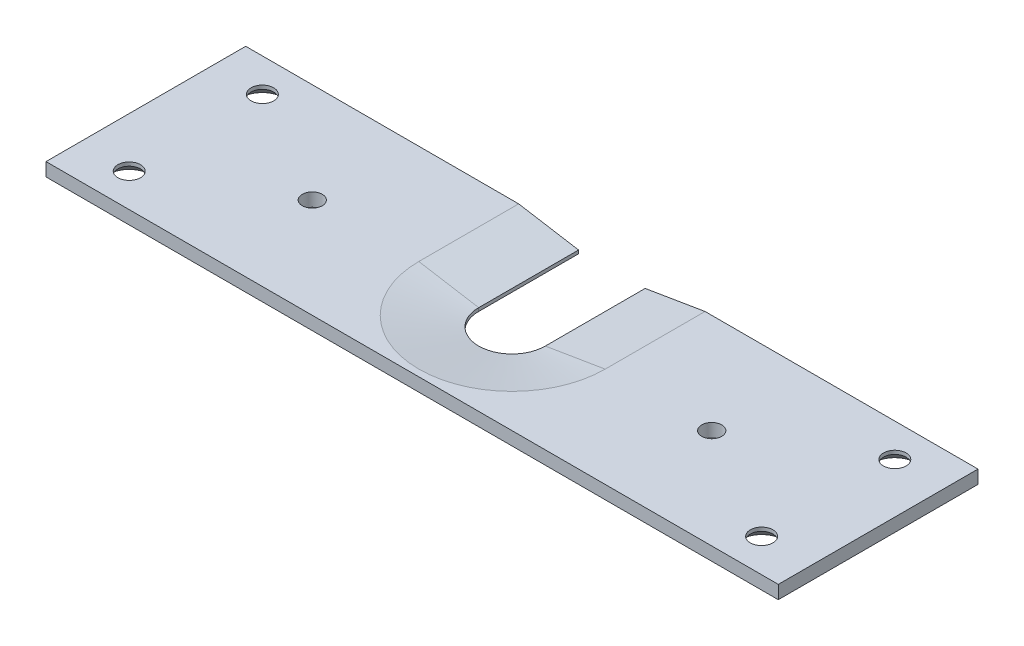
ISO-10303-21;
HEADER;
FILE_DESCRIPTION(('STEP AP214'),'2;1');
FILE_NAME('part.step','',(''),(''),'','','');
FILE_SCHEMA(('AUTOMOTIVE_DESIGN { 1 0 10303 214 1 1 1 1 }'));
ENDSEC;
DATA;
#1=APPLICATION_CONTEXT('core data for automotive mechanical design processes');
#2=APPLICATION_PROTOCOL_DEFINITION('international standard','automotive_design',2000,#1);
#3=PRODUCT_CONTEXT('',#1,'mechanical');
#4=PRODUCT('Part','Part','',(#3));
#5=PRODUCT_RELATED_PRODUCT_CATEGORY('part','',(#4));
#6=PRODUCT_DEFINITION_FORMATION('','',#4);
#7=PRODUCT_DEFINITION_CONTEXT('part definition',#1,'design');
#8=PRODUCT_DEFINITION('design','',#6,#7);
#9=PRODUCT_DEFINITION_SHAPE('','',#8);
#10=(LENGTH_UNIT() NAMED_UNIT(*) SI_UNIT(.MILLI.,.METRE.));
#11=(NAMED_UNIT(*) PLANE_ANGLE_UNIT() SI_UNIT($,.RADIAN.));
#12=(NAMED_UNIT(*) SI_UNIT($,.STERADIAN.) SOLID_ANGLE_UNIT());
#13=UNCERTAINTY_MEASURE_WITH_UNIT(LENGTH_MEASURE(1.E-05),#10,'distance_accuracy_value','');
#14=(GEOMETRIC_REPRESENTATION_CONTEXT(3) GLOBAL_UNCERTAINTY_ASSIGNED_CONTEXT((#13)) GLOBAL_UNIT_ASSIGNED_CONTEXT((#10,
#11,#12)) REPRESENTATION_CONTEXT('',''));
#15=CARTESIAN_POINT('',(0.,0.,0.));
#16=DIRECTION('',(0.,0.,1.));
#17=DIRECTION('',(1.,0.,0.));
#18=AXIS2_PLACEMENT_3D('',#15,#16,#17);
#19=CARTESIAN_POINT('',(-55.,2.,15.));
#20=DIRECTION('',(0.,1.,0.));
#21=DIRECTION('',(0.,0.,1.));
#22=AXIS2_PLACEMENT_3D('',#19,#20,#21);
#23=PLANE('',#22);
#24=CARTESIAN_POINT('',(29.9999999999998,2.,0.));
#25=DIRECTION('',(0.,1.,0.));
#26=DIRECTION('',(0.,0.,1.));
#27=AXIS2_PLACEMENT_3D('',#24,#25,#26);
#28=CIRCLE('',#27,1.49999999999999);
#29=CARTESIAN_POINT('',(29.9999999999998,2.,1.49999999999994));
#30=VERTEX_POINT('',#29);
#31=EDGE_CURVE('E248',#30,#30,#28,.T.);
#32=ORIENTED_EDGE('',*,*,#31,.F.);
#33=EDGE_LOOP('',(#32));
#34=FACE_BOUND('',#33,.T.);
#35=CARTESIAN_POINT('',(-30.,2.,0.));
#36=DIRECTION('',(0.,1.,0.));
#37=DIRECTION('',(0.,0.,1.));
#38=AXIS2_PLACEMENT_3D('',#35,#36,#37);
#39=CIRCLE('',#38,1.49999999999999);
#40=CARTESIAN_POINT('',(-30.,2.,1.49999999999999));
#41=VERTEX_POINT('',#40);
#42=EDGE_CURVE('E242',#41,#41,#39,.T.);
#43=ORIENTED_EDGE('',*,*,#42,.F.);
#44=EDGE_LOOP('',(#43));
#45=FACE_BOUND('',#44,.T.);
#46=CARTESIAN_POINT('',(-47.5,2.00000000000005,-10.));
#47=DIRECTION('',(0.,-1.,0.));
#48=DIRECTION('',(0.,0.,-1.));
#49=AXIS2_PLACEMENT_3D('',#46,#47,#48);
#50=CIRCLE('',#49,1.7);
#51=CARTESIAN_POINT('',(-47.5,2.00000000000005,-11.7));
#52=VERTEX_POINT('',#51);
#53=EDGE_CURVE('E227',#52,#52,#50,.T.);
#54=ORIENTED_EDGE('',*,*,#53,.T.);
#55=EDGE_LOOP('',(#54));
#56=FACE_BOUND('',#55,.T.);
#57=CARTESIAN_POINT('',(47.5,2.00000000000005,10.));
#58=DIRECTION('',(0.,-1.,0.));
#59=DIRECTION('',(0.,0.,-1.));
#60=AXIS2_PLACEMENT_3D('',#57,#58,#59);
#61=CIRCLE('',#60,1.7);
#62=CARTESIAN_POINT('',(47.5,2.00000000000005,8.3));
#63=VERTEX_POINT('',#62);
#64=EDGE_CURVE('E209',#63,#63,#61,.T.);
#65=ORIENTED_EDGE('',*,*,#64,.T.);
#66=EDGE_LOOP('',(#65));
#67=FACE_BOUND('',#66,.T.);
#68=DIRECTION('',(-1.,0.,0.));
#69=VECTOR('',#68,1.);
#70=CARTESIAN_POINT('',(-55.,2.,-15.));
#71=LINE('',#70,#69);
#72=CARTESIAN_POINT('',(55.,2.,-15.));
#73=VERTEX_POINT('',#72);
#74=CARTESIAN_POINT('',(14.0000000000002,2.,-15.));
#75=VERTEX_POINT('',#74);
#76=EDGE_CURVE('E164',#73,#75,#71,.T.);
#77=ORIENTED_EDGE('',*,*,#76,.T.);
#78=DIRECTION('',(0.,0.,1.));
#79=VECTOR('',#78,1.);
#80=CARTESIAN_POINT('',(14.0000000000002,2.,0.));
#81=LINE('',#80,#79);
#82=CARTESIAN_POINT('',(14.0000000000002,2.,0.));
#83=VERTEX_POINT('',#82);
#84=EDGE_CURVE('E187',#75,#83,#81,.T.);
#85=ORIENTED_EDGE('',*,*,#84,.T.);
#86=CARTESIAN_POINT('',(0.,2.,0.));
#87=DIRECTION('',(0.,1.,0.));
#88=DIRECTION('',(0.,0.,1.));
#89=AXIS2_PLACEMENT_3D('',#86,#87,#88);
#90=CIRCLE('',#89,14.0000000000002);
#91=CARTESIAN_POINT('',(-14.0000000000002,2.,0.));
#92=VERTEX_POINT('',#91);
#93=EDGE_CURVE('E185',#83,#92,#90,.F.);
#94=ORIENTED_EDGE('',*,*,#93,.T.);
#95=DIRECTION('',(0.,0.,-1.));
#96=VECTOR('',#95,1.);
#97=CARTESIAN_POINT('',(-14.0000000000002,2.,-15.));
#98=LINE('',#97,#96);
#99=CARTESIAN_POINT('',(-14.0000000000008,2.00000000000005,-15.));
#100=VERTEX_POINT('',#99);
#101=EDGE_CURVE('E183',#92,#100,#98,.T.);
#102=ORIENTED_EDGE('',*,*,#101,.T.);
#103=CARTESIAN_POINT('',(-55.,2.,-15.));
#104=VERTEX_POINT('',#103);
#105=EDGE_CURVE('E163',#100,#104,#71,.T.);
#106=ORIENTED_EDGE('',*,*,#105,.T.);
#107=DIRECTION('',(0.,0.,1.));
#108=VECTOR('',#107,1.);
#109=CARTESIAN_POINT('',(-55.,2.,-15.));
#110=LINE('',#109,#108);
#111=CARTESIAN_POINT('',(-55.,2.,15.));
#112=VERTEX_POINT('',#111);
#113=EDGE_CURVE('E156',#104,#112,#110,.T.);
#114=ORIENTED_EDGE('',*,*,#113,.T.);
#115=DIRECTION('',(1.,0.,0.));
#116=VECTOR('',#115,1.);
#117=CARTESIAN_POINT('',(-55.,2.,15.));
#118=LINE('',#117,#116);
#119=CARTESIAN_POINT('',(55.,2.,15.));
#120=VERTEX_POINT('',#119);
#121=EDGE_CURVE('E159',#112,#120,#118,.T.);
#122=ORIENTED_EDGE('',*,*,#121,.T.);
#123=DIRECTION('',(0.,0.,-1.));
#124=VECTOR('',#123,1.);
#125=CARTESIAN_POINT('',(55.,2.,-15.));
#126=LINE('',#125,#124);
#127=EDGE_CURVE('E161',#120,#73,#126,.T.);
#128=ORIENTED_EDGE('',*,*,#127,.T.);
#129=EDGE_LOOP('',(#77,#85,#94,#102,#106,#114,#122,#128));
#130=FACE_BOUND('',#129,.T.);
#131=CARTESIAN_POINT('',(-47.5,2.00000000000005,10.));
#132=DIRECTION('',(0.,-1.,0.));
#133=DIRECTION('',(0.,0.,-1.));
#134=AXIS2_PLACEMENT_3D('',#131,#132,#133);
#135=CIRCLE('',#134,1.7);
#136=CARTESIAN_POINT('',(-47.5,2.00000000000005,8.3));
#137=VERTEX_POINT('',#136);
#138=EDGE_CURVE('E218',#137,#137,#135,.T.);
#139=ORIENTED_EDGE('',*,*,#138,.T.);
#140=EDGE_LOOP('',(#139));
#141=FACE_BOUND('',#140,.T.);
#142=CARTESIAN_POINT('',(47.5,2.00000000000005,-10.));
#143=DIRECTION('',(0.,-1.,0.));
#144=DIRECTION('',(0.,0.,-1.));
#145=AXIS2_PLACEMENT_3D('',#142,#143,#144);
#146=CIRCLE('',#145,1.7);
#147=CARTESIAN_POINT('',(47.5,2.00000000000005,-11.7));
#148=VERTEX_POINT('',#147);
#149=EDGE_CURVE('E236',#148,#148,#146,.T.);
#150=ORIENTED_EDGE('',*,*,#149,.T.);
#151=EDGE_LOOP('',(#150));
#152=FACE_BOUND('',#151,.T.);
#153=ADVANCED_FACE('F33',(#34,#45,#56,#67,#130,#141,#152),#23,.T.);
#154=CARTESIAN_POINT('',(-55.,2.,-15.));
#155=DIRECTION('',(0.,0.,1.));
#156=DIRECTION('',(1.,0.,0.));
#157=AXIS2_PLACEMENT_3D('',#154,#155,#156);
#158=PLANE('',#157);
#159=ORIENTED_EDGE('',*,*,#105,.F.);
#160=DIRECTION('',(0.986393923832144,-0.164398987305354,0.));
#161=VECTOR('',#160,1.);
#162=CARTESIAN_POINT('',(-5.,0.499999999999999,-15.));
#163=LINE('',#162,#161);
#164=CARTESIAN_POINT('',(-5.,0.499999999999999,-15.));
#165=VERTEX_POINT('',#164);
#166=EDGE_CURVE('E11',#100,#165,#163,.T.);
#167=ORIENTED_EDGE('',*,*,#166,.T.);
#168=DIRECTION('',(0.,1.,0.));
#169=VECTOR('',#168,1.);
#170=CARTESIAN_POINT('',(-5.,0.,-15.));
#171=LINE('',#170,#169);
#172=CARTESIAN_POINT('',(-5.,0.,-15.));
#173=VERTEX_POINT('',#172);
#174=EDGE_CURVE('E144',#173,#165,#171,.T.);
#175=ORIENTED_EDGE('',*,*,#174,.F.);
#176=DIRECTION('',(-1.,0.,0.));
#177=VECTOR('',#176,1.);
#178=CARTESIAN_POINT('',(-55.,0.,-15.));
#179=LINE('',#178,#177);
#180=CARTESIAN_POINT('',(-55.,0.,-15.));
#181=VERTEX_POINT('',#180);
#182=EDGE_CURVE('E153',#173,#181,#179,.T.);
#183=ORIENTED_EDGE('',*,*,#182,.T.);
#184=DIRECTION('',(0.,-1.,0.));
#185=VECTOR('',#184,1.);
#186=CARTESIAN_POINT('',(-55.,2.,-15.));
#187=LINE('',#186,#185);
#188=EDGE_CURVE('E167',#104,#181,#187,.T.);
#189=ORIENTED_EDGE('',*,*,#188,.F.);
#190=EDGE_LOOP('',(#159,#167,#175,#183,#189));
#191=FACE_BOUND('',#190,.T.);
#192=ADVANCED_FACE('F256',(#191),#158,.F.);
#193=CARTESIAN_POINT('',(-55.,2.,-15.));
#194=DIRECTION('',(1.,0.,0.));
#195=DIRECTION('',(0.,0.,-1.));
#196=AXIS2_PLACEMENT_3D('',#193,#194,#195);
#197=PLANE('',#196);
#198=DIRECTION('',(0.,0.,1.));
#199=VECTOR('',#198,1.);
#200=CARTESIAN_POINT('',(-55.,0.,-15.));
#201=LINE('',#200,#199);
#202=CARTESIAN_POINT('',(-55.,0.,15.));
#203=VERTEX_POINT('',#202);
#204=EDGE_CURVE('E143',#181,#203,#201,.T.);
#205=ORIENTED_EDGE('',*,*,#204,.T.);
#206=DIRECTION('',(0.,-1.,0.));
#207=VECTOR('',#206,1.);
#208=CARTESIAN_POINT('',(-55.,2.,15.));
#209=LINE('',#208,#207);
#210=EDGE_CURVE('E176',#112,#203,#209,.T.);
#211=ORIENTED_EDGE('',*,*,#210,.F.);
#212=ORIENTED_EDGE('',*,*,#113,.F.);
#213=ORIENTED_EDGE('',*,*,#188,.T.);
#214=EDGE_LOOP('',(#205,#211,#212,#213));
#215=FACE_BOUND('',#214,.T.);
#216=ADVANCED_FACE('F35',(#215),#197,.F.);
#217=CARTESIAN_POINT('',(-55.,2.,15.));
#218=DIRECTION('',(0.,0.,-1.));
#219=DIRECTION('',(-1.,0.,0.));
#220=AXIS2_PLACEMENT_3D('',#217,#218,#219);
#221=PLANE('',#220);
#222=DIRECTION('',(1.,0.,0.));
#223=VECTOR('',#222,1.);
#224=CARTESIAN_POINT('',(-55.,0.,15.));
#225=LINE('',#224,#223);
#226=CARTESIAN_POINT('',(55.,0.,15.));
#227=VERTEX_POINT('',#226);
#228=EDGE_CURVE('E149',#203,#227,#225,.T.);
#229=ORIENTED_EDGE('',*,*,#228,.T.);
#230=DIRECTION('',(0.,-1.,0.));
#231=VECTOR('',#230,1.);
#232=CARTESIAN_POINT('',(55.,2.,15.));
#233=LINE('',#232,#231);
#234=EDGE_CURVE('E173',#120,#227,#233,.T.);
#235=ORIENTED_EDGE('',*,*,#234,.F.);
#236=ORIENTED_EDGE('',*,*,#121,.F.);
#237=ORIENTED_EDGE('',*,*,#210,.T.);
#238=EDGE_LOOP('',(#229,#235,#236,#237));
#239=FACE_BOUND('',#238,.T.);
#240=ADVANCED_FACE('F294',(#239),#221,.F.);
#241=CARTESIAN_POINT('',(55.,2.,-15.));
#242=DIRECTION('',(-1.,0.,0.));
#243=DIRECTION('',(0.,0.,1.));
#244=AXIS2_PLACEMENT_3D('',#241,#242,#243);
#245=PLANE('',#244);
#246=DIRECTION('',(0.,0.,-1.));
#247=VECTOR('',#246,1.);
#248=CARTESIAN_POINT('',(55.,0.,-15.));
#249=LINE('',#248,#247);
#250=CARTESIAN_POINT('',(55.,0.,-15.));
#251=VERTEX_POINT('',#250);
#252=EDGE_CURVE('E151',#227,#251,#249,.T.);
#253=ORIENTED_EDGE('',*,*,#252,.T.);
#254=DIRECTION('',(0.,-1.,0.));
#255=VECTOR('',#254,1.);
#256=CARTESIAN_POINT('',(55.,2.,-15.));
#257=LINE('',#256,#255);
#258=EDGE_CURVE('E170',#73,#251,#257,.T.);
#259=ORIENTED_EDGE('',*,*,#258,.F.);
#260=ORIENTED_EDGE('',*,*,#127,.F.);
#261=ORIENTED_EDGE('',*,*,#234,.T.);
#262=EDGE_LOOP('',(#253,#259,#260,#261));
#263=FACE_BOUND('',#262,.T.);
#264=ADVANCED_FACE('F287',(#263),#245,.F.);
#265=DIRECTION('',(0.,1.,0.));
#266=VECTOR('',#265,1.);
#267=CARTESIAN_POINT('',(5.,0.,-15.));
#268=LINE('',#267,#266);
#269=CARTESIAN_POINT('',(5.,0.,-15.));
#270=VERTEX_POINT('',#269);
#271=CARTESIAN_POINT('',(5.,0.499999999999999,-15.));
#272=VERTEX_POINT('',#271);
#273=EDGE_CURVE('E120',#270,#272,#268,.T.);
#274=ORIENTED_EDGE('',*,*,#273,.T.);
#275=DIRECTION('',(0.986393923832144,0.164398987305354,0.));
#276=VECTOR('',#275,1.);
#277=CARTESIAN_POINT('',(5.,0.499999999999999,-15.));
#278=LINE('',#277,#276);
#279=EDGE_CURVE('E181',#272,#75,#278,.T.);
#280=ORIENTED_EDGE('',*,*,#279,.T.);
#281=ORIENTED_EDGE('',*,*,#76,.F.);
#282=ORIENTED_EDGE('',*,*,#258,.T.);
#283=EDGE_CURVE('E154',#251,#270,#179,.T.);
#284=ORIENTED_EDGE('',*,*,#283,.T.);
#285=EDGE_LOOP('',(#274,#280,#281,#282,#284));
#286=FACE_BOUND('',#285,.T.);
#287=ADVANCED_FACE('F278',(#286),#158,.F.);
#288=CARTESIAN_POINT('',(-55.,0.,15.));
#289=DIRECTION('',(0.,1.,0.));
#290=DIRECTION('',(0.,0.,1.));
#291=AXIS2_PLACEMENT_3D('',#288,#289,#290);
#292=PLANE('',#291);
#293=CARTESIAN_POINT('',(29.9999999999998,0.,0.));
#294=DIRECTION('',(0.,1.,0.));
#295=DIRECTION('',(0.,0.,1.));
#296=AXIS2_PLACEMENT_3D('',#293,#294,#295);
#297=CIRCLE('',#296,1.5);
#298=CARTESIAN_POINT('',(29.9999999999998,0.,1.49999999999995));
#299=VERTEX_POINT('',#298);
#300=EDGE_CURVE('E245',#299,#299,#297,.T.);
#301=ORIENTED_EDGE('',*,*,#300,.T.);
#302=EDGE_LOOP('',(#301));
#303=FACE_BOUND('',#302,.T.);
#304=CARTESIAN_POINT('',(-30.,0.,0.));
#305=DIRECTION('',(0.,1.,0.));
#306=DIRECTION('',(0.,0.,1.));
#307=AXIS2_PLACEMENT_3D('',#304,#305,#306);
#308=CIRCLE('',#307,1.5);
#309=CARTESIAN_POINT('',(-30.,0.,1.5));
#310=VERTEX_POINT('',#309);
#311=EDGE_CURVE('E239',#310,#310,#308,.T.);
#312=ORIENTED_EDGE('',*,*,#311,.T.);
#313=EDGE_LOOP('',(#312));
#314=FACE_BOUND('',#313,.T.);
#315=CARTESIAN_POINT('',(47.5,0.,-10.));
#316=DIRECTION('',(0.,-1.,0.));
#317=DIRECTION('',(0.,0.,-1.));
#318=AXIS2_PLACEMENT_3D('',#315,#316,#317);
#319=CIRCLE('',#318,3.15);
#320=CARTESIAN_POINT('',(47.5,0.,-13.15));
#321=VERTEX_POINT('',#320);
#322=EDGE_CURVE('E230',#321,#321,#319,.T.);
#323=ORIENTED_EDGE('',*,*,#322,.F.);
#324=EDGE_LOOP('',(#323));
#325=FACE_BOUND('',#324,.T.);
#326=CARTESIAN_POINT('',(-47.5,0.,-10.));
#327=DIRECTION('',(0.,-1.,0.));
#328=DIRECTION('',(0.,0.,-1.));
#329=AXIS2_PLACEMENT_3D('',#326,#327,#328);
#330=CIRCLE('',#329,3.15);
#331=CARTESIAN_POINT('',(-47.5,0.,-13.15));
#332=VERTEX_POINT('',#331);
#333=EDGE_CURVE('E221',#332,#332,#330,.T.);
#334=ORIENTED_EDGE('',*,*,#333,.F.);
#335=EDGE_LOOP('',(#334));
#336=FACE_BOUND('',#335,.T.);
#337=CARTESIAN_POINT('',(-47.5,0.,10.));
#338=DIRECTION('',(0.,-1.,0.));
#339=DIRECTION('',(0.,0.,-1.));
#340=AXIS2_PLACEMENT_3D('',#337,#338,#339);
#341=CIRCLE('',#340,3.15);
#342=CARTESIAN_POINT('',(-47.5,0.,6.85));
#343=VERTEX_POINT('',#342);
#344=EDGE_CURVE('E212',#343,#343,#341,.T.);
#345=ORIENTED_EDGE('',*,*,#344,.F.);
#346=EDGE_LOOP('',(#345));
#347=FACE_BOUND('',#346,.T.);
#348=CARTESIAN_POINT('',(47.5,0.,10.));
#349=DIRECTION('',(0.,-1.,0.));
#350=DIRECTION('',(0.,0.,-1.));
#351=AXIS2_PLACEMENT_3D('',#348,#349,#350);
#352=CIRCLE('',#351,3.15);
#353=CARTESIAN_POINT('',(47.5,0.,6.85));
#354=VERTEX_POINT('',#353);
#355=EDGE_CURVE('E202',#354,#354,#352,.T.);
#356=ORIENTED_EDGE('',*,*,#355,.F.);
#357=EDGE_LOOP('',(#356));
#358=FACE_BOUND('',#357,.T.);
#359=ORIENTED_EDGE('',*,*,#182,.F.);
#360=DIRECTION('',(0.,0.,1.));
#361=VECTOR('',#360,1.);
#362=CARTESIAN_POINT('',(-5.,0.,0.));
#363=LINE('',#362,#361);
#364=CARTESIAN_POINT('',(-5.,0.,0.));
#365=VERTEX_POINT('',#364);
#366=EDGE_CURVE('E121',#173,#365,#363,.T.);
#367=ORIENTED_EDGE('',*,*,#366,.T.);
#368=CARTESIAN_POINT('',(0.,0.,0.));
#369=DIRECTION('',(0.,1.,0.));
#370=DIRECTION('',(0.,0.,1.));
#371=AXIS2_PLACEMENT_3D('',#368,#369,#370);
#372=CIRCLE('',#371,5.);
#373=CARTESIAN_POINT('',(5.,0.,0.));
#374=VERTEX_POINT('',#373);
#375=EDGE_CURVE('E113',#365,#374,#372,.T.);
#376=ORIENTED_EDGE('',*,*,#375,.T.);
#377=DIRECTION('',(0.,0.,-1.));
#378=VECTOR('',#377,1.);
#379=CARTESIAN_POINT('',(5.,0.,0.));
#380=LINE('',#379,#378);
#381=EDGE_CURVE('E124',#374,#270,#380,.T.);
#382=ORIENTED_EDGE('',*,*,#381,.T.);
#383=ORIENTED_EDGE('',*,*,#283,.F.);
#384=ORIENTED_EDGE('',*,*,#252,.F.);
#385=ORIENTED_EDGE('',*,*,#228,.F.);
#386=ORIENTED_EDGE('',*,*,#204,.F.);
#387=EDGE_LOOP('',(#359,#367,#376,#382,#383,#384,#385,#386));
#388=FACE_BOUND('',#387,.T.);
#389=ADVANCED_FACE('F132',(#303,#314,#325,#336,#347,#358,#388),#292,.F.);
#390=CARTESIAN_POINT('',(0.,0.,0.));
#391=DIRECTION('',(0.,1.,0.));
#392=DIRECTION('',(0.,0.,1.));
#393=AXIS2_PLACEMENT_3D('',#390,#391,#392);
#394=CYLINDRICAL_SURFACE('',#393,5.);
#395=DIRECTION('',(0.,1.,0.));
#396=VECTOR('',#395,1.);
#397=CARTESIAN_POINT('',(-5.,0.,0.));
#398=LINE('',#397,#396);
#399=CARTESIAN_POINT('',(-5.,0.499999999999999,0.));
#400=VERTEX_POINT('',#399);
#401=EDGE_CURVE('E141',#365,#400,#398,.T.);
#402=ORIENTED_EDGE('',*,*,#401,.T.);
#403=CARTESIAN_POINT('',(0.,0.499999999999999,0.));
#404=DIRECTION('',(0.,1.,0.));
#405=DIRECTION('',(0.,0.,1.));
#406=AXIS2_PLACEMENT_3D('',#403,#404,#405);
#407=CIRCLE('',#406,5.);
#408=CARTESIAN_POINT('',(5.,0.499999999999999,0.));
#409=VERTEX_POINT('',#408);
#410=EDGE_CURVE('E116',#400,#409,#407,.T.);
#411=ORIENTED_EDGE('',*,*,#410,.T.);
#412=DIRECTION('',(0.,1.,0.));
#413=VECTOR('',#412,1.);
#414=CARTESIAN_POINT('',(5.,0.,0.));
#415=LINE('',#414,#413);
#416=EDGE_CURVE('E109',#374,#409,#415,.T.);
#417=ORIENTED_EDGE('',*,*,#416,.F.);
#418=ORIENTED_EDGE('',*,*,#375,.F.);
#419=EDGE_LOOP('',(#402,#411,#417,#418));
#420=FACE_BOUND('',#419,.T.);
#421=ADVANCED_FACE('F111',(#420),#394,.F.);
#422=CARTESIAN_POINT('',(-5.,0.,0.));
#423=DIRECTION('',(-1.,0.,0.));
#424=DIRECTION('',(0.,0.,1.));
#425=AXIS2_PLACEMENT_3D('',#422,#423,#424);
#426=PLANE('',#425);
#427=ORIENTED_EDGE('',*,*,#174,.T.);
#428=DIRECTION('',(0.,0.,1.));
#429=VECTOR('',#428,1.);
#430=CARTESIAN_POINT('',(-5.,0.499999999999999,0.));
#431=LINE('',#430,#429);
#432=EDGE_CURVE('E41',#165,#400,#431,.T.);
#433=ORIENTED_EDGE('',*,*,#432,.T.);
#434=ORIENTED_EDGE('',*,*,#401,.F.);
#435=ORIENTED_EDGE('',*,*,#366,.F.);
#436=EDGE_LOOP('',(#427,#433,#434,#435));
#437=FACE_BOUND('',#436,.T.);
#438=ADVANCED_FACE('F285',(#437),#426,.F.);
#439=CARTESIAN_POINT('',(5.,0.,0.));
#440=DIRECTION('',(1.,0.,0.));
#441=DIRECTION('',(0.,0.,-1.));
#442=AXIS2_PLACEMENT_3D('',#439,#440,#441);
#443=PLANE('',#442);
#444=ORIENTED_EDGE('',*,*,#416,.T.);
#445=DIRECTION('',(0.,0.,-1.));
#446=VECTOR('',#445,1.);
#447=CARTESIAN_POINT('',(5.,0.499999999999999,-15.));
#448=LINE('',#447,#446);
#449=EDGE_CURVE('E179',#409,#272,#448,.T.);
#450=ORIENTED_EDGE('',*,*,#449,.T.);
#451=ORIENTED_EDGE('',*,*,#273,.F.);
#452=ORIENTED_EDGE('',*,*,#381,.F.);
#453=EDGE_LOOP('',(#444,#450,#451,#452));
#454=FACE_BOUND('',#453,.T.);
#455=ADVANCED_FACE('F125',(#454),#443,.F.);
#456=CARTESIAN_POINT('',(-5.,0.499999999999999,0.));
#457=DIRECTION('',(0.164398987305354,0.986393923832144,0.));
#458=DIRECTION('',(-0.986393923832144,0.164398987305354,0.));
#459=AXIS2_PLACEMENT_3D('',#456,#457,#458);
#460=PLANE('',#459);
#461=ORIENTED_EDGE('',*,*,#166,.F.);
#462=ORIENTED_EDGE('',*,*,#101,.F.);
#463=DIRECTION('',(-0.986393923832144,0.164398987305354,0.));
#464=VECTOR('',#463,1.);
#465=CARTESIAN_POINT('',(-5.,0.499999999999999,0.));
#466=LINE('',#465,#464);
#467=EDGE_CURVE('E133',#400,#92,#466,.T.);
#468=ORIENTED_EDGE('',*,*,#467,.F.);
#469=ORIENTED_EDGE('',*,*,#432,.F.);
#470=EDGE_LOOP('',(#461,#462,#468,#469));
#471=FACE_BOUND('',#470,.T.);
#472=ADVANCED_FACE('F311',(#471),#460,.T.);
#473=CARTESIAN_POINT('',(0.,0.499999999999999,0.));
#474=DIRECTION('',(0.,1.,0.));
#475=DIRECTION('',(0.,0.,1.));
#476=AXIS2_PLACEMENT_3D('',#473,#474,#475);
#477=CONICAL_SURFACE('',#476,5.,1.40564764938027);
#478=ORIENTED_EDGE('',*,*,#467,.T.);
#479=ORIENTED_EDGE('',*,*,#93,.F.);
#480=DIRECTION('',(0.986393923832144,0.164398987305354,0.));
#481=VECTOR('',#480,1.);
#482=CARTESIAN_POINT('',(5.,0.499999999999999,0.));
#483=LINE('',#482,#481);
#484=EDGE_CURVE('E136',#409,#83,#483,.T.);
#485=ORIENTED_EDGE('',*,*,#484,.F.);
#486=ORIENTED_EDGE('',*,*,#410,.F.);
#487=EDGE_LOOP('',(#478,#479,#485,#486));
#488=FACE_BOUND('',#487,.T.);
#489=ADVANCED_FACE('F198',(#488),#477,.F.);
#490=CARTESIAN_POINT('',(5.,0.499999999999999,0.));
#491=DIRECTION('',(-0.164398987305354,0.986393923832144,0.));
#492=DIRECTION('',(-0.986393923832144,-0.164398987305354,0.));
#493=AXIS2_PLACEMENT_3D('',#490,#491,#492);
#494=PLANE('',#493);
#495=ORIENTED_EDGE('',*,*,#484,.T.);
#496=ORIENTED_EDGE('',*,*,#84,.F.);
#497=ORIENTED_EDGE('',*,*,#279,.F.);
#498=ORIENTED_EDGE('',*,*,#449,.F.);
#499=EDGE_LOOP('',(#495,#496,#497,#498));
#500=FACE_BOUND('',#499,.T.);
#501=ADVANCED_FACE('F201',(#500),#494,.T.);
#502=CARTESIAN_POINT('',(47.5,0.,10.));
#503=DIRECTION('',(0.,-1.,0.));
#504=DIRECTION('',(0.,0.,-1.));
#505=AXIS2_PLACEMENT_3D('',#502,#503,#504);
#506=CONICAL_SURFACE('',#505,3.15,0.785398163397449);
#507=CARTESIAN_POINT('',(47.5,1.45,10.));
#508=DIRECTION('',(0.,-1.,0.));
#509=DIRECTION('',(0.,0.,-1.));
#510=AXIS2_PLACEMENT_3D('',#507,#508,#509);
#511=CIRCLE('',#510,1.7);
#512=CARTESIAN_POINT('',(47.5,1.45,8.3));
#513=VERTEX_POINT('',#512);
#514=EDGE_CURVE('E204',#513,#513,#511,.T.);
#515=ORIENTED_EDGE('',*,*,#514,.F.);
#516=EDGE_LOOP('',(#515));
#517=FACE_BOUND('',#516,.T.);
#518=ORIENTED_EDGE('',*,*,#355,.T.);
#519=EDGE_LOOP('',(#518));
#520=FACE_BOUND('',#519,.T.);
#521=ADVANCED_FACE('F268',(#517,#520),#506,.F.);
#522=CARTESIAN_POINT('',(47.5,0.,10.));
#523=DIRECTION('',(0.,-1.,0.));
#524=DIRECTION('',(0.,0.,-1.));
#525=AXIS2_PLACEMENT_3D('',#522,#523,#524);
#526=CYLINDRICAL_SURFACE('',#525,1.7);
#527=ORIENTED_EDGE('',*,*,#64,.F.);
#528=EDGE_LOOP('',(#527));
#529=FACE_BOUND('',#528,.T.);
#530=ORIENTED_EDGE('',*,*,#514,.T.);
#531=EDGE_LOOP('',(#530));
#532=FACE_BOUND('',#531,.T.);
#533=ADVANCED_FACE('F264',(#529,#532),#526,.F.);
#534=CARTESIAN_POINT('',(-47.5,0.,10.));
#535=DIRECTION('',(0.,-1.,0.));
#536=DIRECTION('',(0.,0.,-1.));
#537=AXIS2_PLACEMENT_3D('',#534,#535,#536);
#538=CONICAL_SURFACE('',#537,3.15,0.785398163397449);
#539=CARTESIAN_POINT('',(-47.5,1.45,10.));
#540=DIRECTION('',(0.,-1.,0.));
#541=DIRECTION('',(0.,0.,-1.));
#542=AXIS2_PLACEMENT_3D('',#539,#540,#541);
#543=CIRCLE('',#542,1.7);
#544=CARTESIAN_POINT('',(-47.5,1.45,8.3));
#545=VERTEX_POINT('',#544);
#546=EDGE_CURVE('E215',#545,#545,#543,.T.);
#547=ORIENTED_EDGE('',*,*,#546,.F.);
#548=EDGE_LOOP('',(#547));
#549=FACE_BOUND('',#548,.T.);
#550=ORIENTED_EDGE('',*,*,#344,.T.);
#551=EDGE_LOOP('',(#550));
#552=FACE_BOUND('',#551,.T.);
#553=ADVANCED_FACE('F267',(#549,#552),#538,.F.);
#554=CARTESIAN_POINT('',(-47.5,0.,10.));
#555=DIRECTION('',(0.,-1.,0.));
#556=DIRECTION('',(0.,0.,-1.));
#557=AXIS2_PLACEMENT_3D('',#554,#555,#556);
#558=CYLINDRICAL_SURFACE('',#557,1.7);
#559=ORIENTED_EDGE('',*,*,#138,.F.);
#560=EDGE_LOOP('',(#559));
#561=FACE_BOUND('',#560,.T.);
#562=ORIENTED_EDGE('',*,*,#546,.T.);
#563=EDGE_LOOP('',(#562));
#564=FACE_BOUND('',#563,.T.);
#565=ADVANCED_FACE('F369',(#561,#564),#558,.F.);
#566=CARTESIAN_POINT('',(-47.5,0.,-10.));
#567=DIRECTION('',(0.,-1.,0.));
#568=DIRECTION('',(0.,0.,-1.));
#569=AXIS2_PLACEMENT_3D('',#566,#567,#568);
#570=CONICAL_SURFACE('',#569,3.15,0.785398163397449);
#571=CARTESIAN_POINT('',(-47.5,1.45,-10.));
#572=DIRECTION('',(0.,-1.,0.));
#573=DIRECTION('',(0.,0.,-1.));
#574=AXIS2_PLACEMENT_3D('',#571,#572,#573);
#575=CIRCLE('',#574,1.7);
#576=CARTESIAN_POINT('',(-47.5,1.45,-11.7));
#577=VERTEX_POINT('',#576);
#578=EDGE_CURVE('E224',#577,#577,#575,.T.);
#579=ORIENTED_EDGE('',*,*,#578,.F.);
#580=EDGE_LOOP('',(#579));
#581=FACE_BOUND('',#580,.T.);
#582=ORIENTED_EDGE('',*,*,#333,.T.);
#583=EDGE_LOOP('',(#582));
#584=FACE_BOUND('',#583,.T.);
#585=ADVANCED_FACE('F379',(#581,#584),#570,.F.);
#586=CARTESIAN_POINT('',(-47.5,0.,-10.));
#587=DIRECTION('',(0.,-1.,0.));
#588=DIRECTION('',(0.,0.,-1.));
#589=AXIS2_PLACEMENT_3D('',#586,#587,#588);
#590=CYLINDRICAL_SURFACE('',#589,1.7);
#591=ORIENTED_EDGE('',*,*,#53,.F.);
#592=EDGE_LOOP('',(#591));
#593=FACE_BOUND('',#592,.T.);
#594=ORIENTED_EDGE('',*,*,#578,.T.);
#595=EDGE_LOOP('',(#594));
#596=FACE_BOUND('',#595,.T.);
#597=ADVANCED_FACE('F389',(#593,#596),#590,.F.);
#598=CARTESIAN_POINT('',(47.5,0.,-10.));
#599=DIRECTION('',(0.,-1.,0.));
#600=DIRECTION('',(0.,0.,-1.));
#601=AXIS2_PLACEMENT_3D('',#598,#599,#600);
#602=CONICAL_SURFACE('',#601,3.15,0.785398163397449);
#603=CARTESIAN_POINT('',(47.5,1.45,-10.));
#604=DIRECTION('',(0.,-1.,0.));
#605=DIRECTION('',(0.,0.,-1.));
#606=AXIS2_PLACEMENT_3D('',#603,#604,#605);
#607=CIRCLE('',#606,1.7);
#608=CARTESIAN_POINT('',(47.5,1.45,-11.7));
#609=VERTEX_POINT('',#608);
#610=EDGE_CURVE('E233',#609,#609,#607,.T.);
#611=ORIENTED_EDGE('',*,*,#610,.F.);
#612=EDGE_LOOP('',(#611));
#613=FACE_BOUND('',#612,.T.);
#614=ORIENTED_EDGE('',*,*,#322,.T.);
#615=EDGE_LOOP('',(#614));
#616=FACE_BOUND('',#615,.T.);
#617=ADVANCED_FACE('F399',(#613,#616),#602,.F.);
#618=CARTESIAN_POINT('',(47.5,0.,-10.));
#619=DIRECTION('',(0.,-1.,0.));
#620=DIRECTION('',(0.,0.,-1.));
#621=AXIS2_PLACEMENT_3D('',#618,#619,#620);
#622=CYLINDRICAL_SURFACE('',#621,1.7);
#623=ORIENTED_EDGE('',*,*,#149,.F.);
#624=EDGE_LOOP('',(#623));
#625=FACE_BOUND('',#624,.T.);
#626=ORIENTED_EDGE('',*,*,#610,.T.);
#627=EDGE_LOOP('',(#626));
#628=FACE_BOUND('',#627,.T.);
#629=ADVANCED_FACE('F409',(#625,#628),#622,.F.);
#630=CARTESIAN_POINT('',(-30.,2.,0.));
#631=DIRECTION('',(0.,1.,0.));
#632=DIRECTION('',(0.,0.,1.));
#633=AXIS2_PLACEMENT_3D('',#630,#631,#632);
#634=CYLINDRICAL_SURFACE('',#633,1.49999999999999);
#635=ORIENTED_EDGE('',*,*,#311,.F.);
#636=EDGE_LOOP('',(#635));
#637=FACE_BOUND('',#636,.T.);
#638=ORIENTED_EDGE('',*,*,#42,.T.);
#639=EDGE_LOOP('',(#638));
#640=FACE_BOUND('',#639,.T.);
#641=ADVANCED_FACE('F419',(#637,#640),#634,.F.);
#642=CARTESIAN_POINT('',(29.9999999999998,2.,0.));
#643=DIRECTION('',(0.,1.,0.));
#644=DIRECTION('',(0.,0.,1.));
#645=AXIS2_PLACEMENT_3D('',#642,#643,#644);
#646=CYLINDRICAL_SURFACE('',#645,1.49999999999999);
#647=ORIENTED_EDGE('',*,*,#300,.F.);
#648=EDGE_LOOP('',(#647));
#649=FACE_BOUND('',#648,.T.);
#650=ORIENTED_EDGE('',*,*,#31,.T.);
#651=EDGE_LOOP('',(#650));
#652=FACE_BOUND('',#651,.T.);
#653=ADVANCED_FACE('F252',(#649,#652),#646,.F.);
#654=CLOSED_SHELL('',(#153,#192,#216,#240,#264,#287,#389,#421,#438,#455,#472,#489,#501,#521,
#533,#553,#565,#585,#597,#617,#629,#641,#653));
#655=MANIFOLD_SOLID_BREP('B2',#654);
#656=ADVANCED_BREP_SHAPE_REPRESENTATION('',(#18,#655),#14);
#657=SHAPE_DEFINITION_REPRESENTATION(#9,#656);
ENDSEC;
END-ISO-10303-21;
